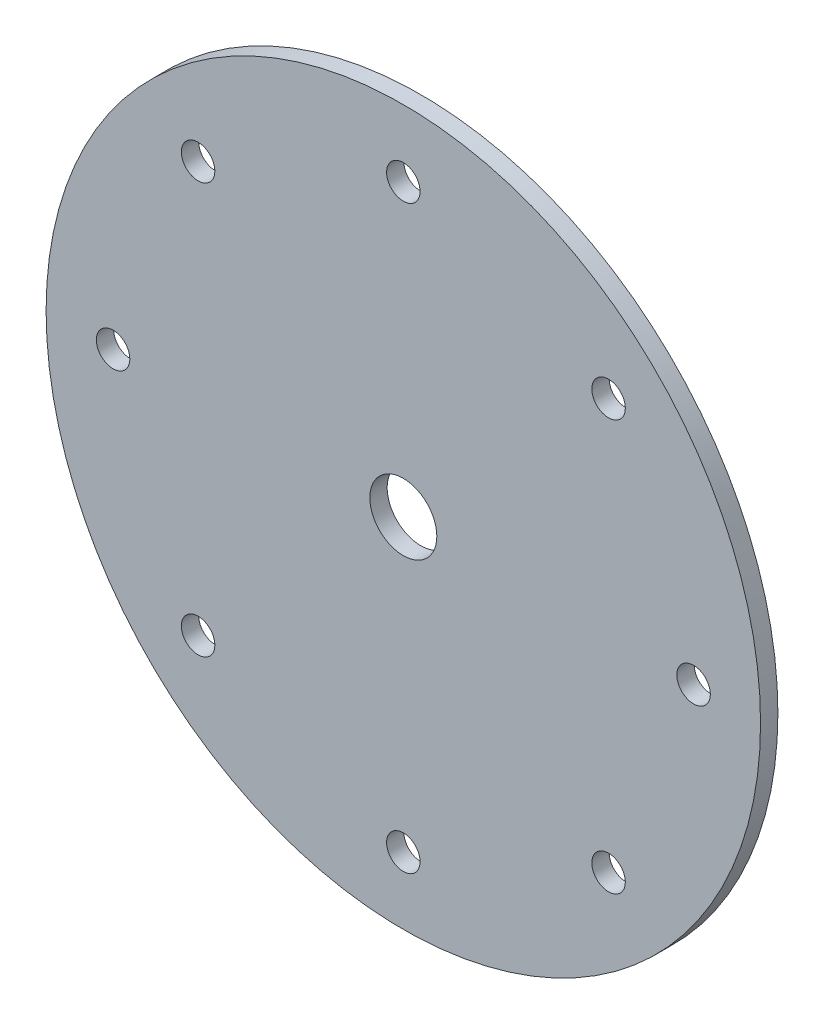
ISO-10303-21;
HEADER;
FILE_DESCRIPTION(('STEP AP214'),'2;1');
FILE_NAME('part.step','',(''),(''),'','','');
FILE_SCHEMA(('AUTOMOTIVE_DESIGN { 1 0 10303 214 1 1 1 1 }'));
ENDSEC;
DATA;
#1=APPLICATION_CONTEXT('core data for automotive mechanical design processes');
#2=APPLICATION_PROTOCOL_DEFINITION('international standard','automotive_design',2000,#1);
#3=PRODUCT_CONTEXT('',#1,'mechanical');
#4=PRODUCT('Part','Part','',(#3));
#5=PRODUCT_RELATED_PRODUCT_CATEGORY('part','',(#4));
#6=PRODUCT_DEFINITION_FORMATION('','',#4);
#7=PRODUCT_DEFINITION_CONTEXT('part definition',#1,'design');
#8=PRODUCT_DEFINITION('design','',#6,#7);
#9=PRODUCT_DEFINITION_SHAPE('','',#8);
#10=(LENGTH_UNIT() NAMED_UNIT(*) SI_UNIT(.MILLI.,.METRE.));
#11=(NAMED_UNIT(*) PLANE_ANGLE_UNIT() SI_UNIT($,.RADIAN.));
#12=(NAMED_UNIT(*) SI_UNIT($,.STERADIAN.) SOLID_ANGLE_UNIT());
#13=UNCERTAINTY_MEASURE_WITH_UNIT(LENGTH_MEASURE(1.E-05),#10,'distance_accuracy_value','');
#14=(GEOMETRIC_REPRESENTATION_CONTEXT(3) GLOBAL_UNCERTAINTY_ASSIGNED_CONTEXT((#13)) GLOBAL_UNIT_ASSIGNED_CONTEXT((#10,
#11,#12)) REPRESENTATION_CONTEXT('',''));
#15=CARTESIAN_POINT('',(0.,0.,0.));
#16=DIRECTION('',(0.,0.,1.));
#17=DIRECTION('',(1.,0.,0.));
#18=AXIS2_PLACEMENT_3D('',#15,#16,#17);
#19=CARTESIAN_POINT('',(0.,0.,4.93522));
#20=DIRECTION('',(0.,0.,-1.));
#21=DIRECTION('',(-1.,0.,0.));
#22=AXIS2_PLACEMENT_3D('',#19,#20,#21);
#23=CYLINDRICAL_SURFACE('',#22,9.525);
#24=CARTESIAN_POINT('',(0.,0.,4.93522));
#25=DIRECTION('',(0.,0.,1.));
#26=DIRECTION('',(1.,0.,0.));
#27=AXIS2_PLACEMENT_3D('',#24,#25,#26);
#28=CIRCLE('',#27,9.525);
#29=CARTESIAN_POINT('',(9.525,0.,4.93522));
#30=VERTEX_POINT('',#29);
#31=EDGE_CURVE('E46',#30,#30,#28,.T.);
#32=ORIENTED_EDGE('',*,*,#31,.T.);
#33=EDGE_LOOP('',(#32));
#34=FACE_BOUND('',#33,.T.);
#35=CARTESIAN_POINT('',(0.,0.,0.));
#36=DIRECTION('',(0.,0.,1.));
#37=DIRECTION('',(1.,0.,0.));
#38=AXIS2_PLACEMENT_3D('',#35,#36,#37);
#39=CIRCLE('',#38,9.525);
#40=CARTESIAN_POINT('',(9.525,0.,0.));
#41=VERTEX_POINT('',#40);
#42=EDGE_CURVE('E78',#41,#41,#39,.T.);
#43=ORIENTED_EDGE('',*,*,#42,.F.);
#44=EDGE_LOOP('',(#43));
#45=FACE_BOUND('',#44,.T.);
#46=ADVANCED_FACE('F38',(#34,#45),#23,.F.);
#47=CARTESIAN_POINT('',(0.,82.55,4.93522));
#48=DIRECTION('',(0.,0.,-1.));
#49=DIRECTION('',(-1.,0.,0.));
#50=AXIS2_PLACEMENT_3D('',#47,#48,#49);
#51=CYLINDRICAL_SURFACE('',#50,4.7625);
#52=CARTESIAN_POINT('',(0.,82.55,4.93522));
#53=DIRECTION('',(0.,0.,1.));
#54=DIRECTION('',(1.,0.,0.));
#55=AXIS2_PLACEMENT_3D('',#52,#53,#54);
#56=CIRCLE('',#55,4.7625);
#57=CARTESIAN_POINT('',(4.7625,82.55,4.93522));
#58=VERTEX_POINT('',#57);
#59=EDGE_CURVE('E51',#58,#58,#56,.T.);
#60=ORIENTED_EDGE('',*,*,#59,.T.);
#61=EDGE_LOOP('',(#60));
#62=FACE_BOUND('',#61,.T.);
#63=CARTESIAN_POINT('',(0.,82.55,0.));
#64=DIRECTION('',(0.,0.,1.));
#65=DIRECTION('',(1.,0.,0.));
#66=AXIS2_PLACEMENT_3D('',#63,#64,#65);
#67=CIRCLE('',#66,4.7625);
#68=CARTESIAN_POINT('',(4.7625,82.55,0.));
#69=VERTEX_POINT('',#68);
#70=EDGE_CURVE('E76',#69,#69,#67,.T.);
#71=ORIENTED_EDGE('',*,*,#70,.F.);
#72=EDGE_LOOP('',(#71));
#73=FACE_BOUND('',#72,.T.);
#74=ADVANCED_FACE('F111',(#62,#73),#51,.F.);
#75=CARTESIAN_POINT('',(58.3716647869495,58.3716647869495,4.93522));
#76=DIRECTION('',(0.,0.,-1.));
#77=DIRECTION('',(-1.,0.,0.));
#78=AXIS2_PLACEMENT_3D('',#75,#76,#77);
#79=CYLINDRICAL_SURFACE('',#78,4.76249999999999);
#80=CARTESIAN_POINT('',(58.3716647869495,58.3716647869495,4.93522));
#81=DIRECTION('',(0.,0.,1.));
#82=DIRECTION('',(1.,0.,0.));
#83=AXIS2_PLACEMENT_3D('',#80,#81,#82);
#84=CIRCLE('',#83,4.76249999999999);
#85=CARTESIAN_POINT('',(63.1341647869495,58.3716647869495,4.93522));
#86=VERTEX_POINT('',#85);
#87=EDGE_CURVE('E106',#86,#86,#84,.T.);
#88=ORIENTED_EDGE('',*,*,#87,.T.);
#89=EDGE_LOOP('',(#88));
#90=FACE_BOUND('',#89,.T.);
#91=CARTESIAN_POINT('',(58.3716647869495,58.3716647869495,0.));
#92=DIRECTION('',(0.,0.,1.));
#93=DIRECTION('',(1.,0.,0.));
#94=AXIS2_PLACEMENT_3D('',#91,#92,#93);
#95=CIRCLE('',#94,4.76249999999999);
#96=CARTESIAN_POINT('',(63.1341647869495,58.3716647869495,0.));
#97=VERTEX_POINT('',#96);
#98=EDGE_CURVE('E73',#97,#97,#95,.T.);
#99=ORIENTED_EDGE('',*,*,#98,.F.);
#100=EDGE_LOOP('',(#99));
#101=FACE_BOUND('',#100,.T.);
#102=ADVANCED_FACE('F129',(#90,#101),#79,.F.);
#103=CARTESIAN_POINT('',(82.55,0.,4.93522));
#104=DIRECTION('',(0.,0.,-1.));
#105=DIRECTION('',(-1.,0.,0.));
#106=AXIS2_PLACEMENT_3D('',#103,#104,#105);
#107=CYLINDRICAL_SURFACE('',#106,4.7625);
#108=CARTESIAN_POINT('',(82.55,0.,4.93522));
#109=DIRECTION('',(0.,0.,1.));
#110=DIRECTION('',(1.,0.,0.));
#111=AXIS2_PLACEMENT_3D('',#108,#109,#110);
#112=CIRCLE('',#111,4.7625);
#113=CARTESIAN_POINT('',(87.3125,0.,4.93522));
#114=VERTEX_POINT('',#113);
#115=EDGE_CURVE('E103',#114,#114,#112,.T.);
#116=ORIENTED_EDGE('',*,*,#115,.T.);
#117=EDGE_LOOP('',(#116));
#118=FACE_BOUND('',#117,.T.);
#119=CARTESIAN_POINT('',(82.55,0.,0.));
#120=DIRECTION('',(0.,0.,1.));
#121=DIRECTION('',(1.,0.,0.));
#122=AXIS2_PLACEMENT_3D('',#119,#120,#121);
#123=CIRCLE('',#122,4.7625);
#124=CARTESIAN_POINT('',(87.3125,0.,0.));
#125=VERTEX_POINT('',#124);
#126=EDGE_CURVE('E70',#125,#125,#123,.T.);
#127=ORIENTED_EDGE('',*,*,#126,.F.);
#128=EDGE_LOOP('',(#127));
#129=FACE_BOUND('',#128,.T.);
#130=ADVANCED_FACE('F136',(#118,#129),#107,.F.);
#131=CARTESIAN_POINT('',(58.3716647869495,-58.3716647869495,4.93522));
#132=DIRECTION('',(0.,0.,-1.));
#133=DIRECTION('',(-1.,0.,0.));
#134=AXIS2_PLACEMENT_3D('',#131,#132,#133);
#135=CYLINDRICAL_SURFACE('',#134,4.7625);
#136=CARTESIAN_POINT('',(58.3716647869495,-58.3716647869495,4.93522));
#137=DIRECTION('',(0.,0.,1.));
#138=DIRECTION('',(1.,0.,0.));
#139=AXIS2_PLACEMENT_3D('',#136,#137,#138);
#140=CIRCLE('',#139,4.7625);
#141=CARTESIAN_POINT('',(63.1341647869495,-58.3716647869495,4.93522));
#142=VERTEX_POINT('',#141);
#143=EDGE_CURVE('E100',#142,#142,#140,.T.);
#144=ORIENTED_EDGE('',*,*,#143,.T.);
#145=EDGE_LOOP('',(#144));
#146=FACE_BOUND('',#145,.T.);
#147=CARTESIAN_POINT('',(58.3716647869495,-58.3716647869495,0.));
#148=DIRECTION('',(0.,0.,1.));
#149=DIRECTION('',(1.,0.,0.));
#150=AXIS2_PLACEMENT_3D('',#147,#148,#149);
#151=CIRCLE('',#150,4.7625);
#152=CARTESIAN_POINT('',(63.1341647869495,-58.3716647869495,0.));
#153=VERTEX_POINT('',#152);
#154=EDGE_CURVE('E67',#153,#153,#151,.T.);
#155=ORIENTED_EDGE('',*,*,#154,.F.);
#156=EDGE_LOOP('',(#155));
#157=FACE_BOUND('',#156,.T.);
#158=ADVANCED_FACE('F140',(#146,#157),#135,.F.);
#159=CARTESIAN_POINT('',(0.,-82.55,4.93522));
#160=DIRECTION('',(0.,0.,-1.));
#161=DIRECTION('',(-1.,0.,0.));
#162=AXIS2_PLACEMENT_3D('',#159,#160,#161);
#163=CYLINDRICAL_SURFACE('',#162,4.7625);
#164=CARTESIAN_POINT('',(0.,-82.55,4.93522));
#165=DIRECTION('',(0.,0.,1.));
#166=DIRECTION('',(1.,0.,0.));
#167=AXIS2_PLACEMENT_3D('',#164,#165,#166);
#168=CIRCLE('',#167,4.7625);
#169=CARTESIAN_POINT('',(4.76250000000002,-82.55,4.93522));
#170=VERTEX_POINT('',#169);
#171=EDGE_CURVE('E97',#170,#170,#168,.T.);
#172=ORIENTED_EDGE('',*,*,#171,.T.);
#173=EDGE_LOOP('',(#172));
#174=FACE_BOUND('',#173,.T.);
#175=CARTESIAN_POINT('',(0.,-82.55,0.));
#176=DIRECTION('',(0.,0.,1.));
#177=DIRECTION('',(1.,0.,0.));
#178=AXIS2_PLACEMENT_3D('',#175,#176,#177);
#179=CIRCLE('',#178,4.7625);
#180=CARTESIAN_POINT('',(4.76250000000002,-82.55,0.));
#181=VERTEX_POINT('',#180);
#182=EDGE_CURVE('E64',#181,#181,#179,.T.);
#183=ORIENTED_EDGE('',*,*,#182,.F.);
#184=EDGE_LOOP('',(#183));
#185=FACE_BOUND('',#184,.T.);
#186=ADVANCED_FACE('F144',(#174,#185),#163,.F.);
#187=CARTESIAN_POINT('',(-58.3716647869495,-58.3716647869495,4.93522));
#188=DIRECTION('',(0.,0.,-1.));
#189=DIRECTION('',(-1.,0.,0.));
#190=AXIS2_PLACEMENT_3D('',#187,#188,#189);
#191=CYLINDRICAL_SURFACE('',#190,4.7625);
#192=CARTESIAN_POINT('',(-58.3716647869495,-58.3716647869495,4.93522));
#193=DIRECTION('',(0.,0.,1.));
#194=DIRECTION('',(1.,0.,0.));
#195=AXIS2_PLACEMENT_3D('',#192,#193,#194);
#196=CIRCLE('',#195,4.7625);
#197=CARTESIAN_POINT('',(-53.6091647869495,-58.3716647869495,4.93522));
#198=VERTEX_POINT('',#197);
#199=EDGE_CURVE('E92',#198,#198,#196,.T.);
#200=ORIENTED_EDGE('',*,*,#199,.T.);
#201=EDGE_LOOP('',(#200));
#202=FACE_BOUND('',#201,.T.);
#203=CARTESIAN_POINT('',(-58.3716647869495,-58.3716647869495,0.));
#204=DIRECTION('',(0.,0.,1.));
#205=DIRECTION('',(1.,0.,0.));
#206=AXIS2_PLACEMENT_3D('',#203,#204,#205);
#207=CIRCLE('',#206,4.7625);
#208=CARTESIAN_POINT('',(-53.6091647869495,-58.3716647869495,0.));
#209=VERTEX_POINT('',#208);
#210=EDGE_CURVE('E61',#209,#209,#207,.T.);
#211=ORIENTED_EDGE('',*,*,#210,.F.);
#212=EDGE_LOOP('',(#211));
#213=FACE_BOUND('',#212,.T.);
#214=ADVANCED_FACE('F148',(#202,#213),#191,.F.);
#215=CARTESIAN_POINT('',(-82.55,0.,4.93522));
#216=DIRECTION('',(0.,0.,-1.));
#217=DIRECTION('',(-1.,0.,0.));
#218=AXIS2_PLACEMENT_3D('',#215,#216,#217);
#219=CYLINDRICAL_SURFACE('',#218,4.7625);
#220=CARTESIAN_POINT('',(-82.55,0.,4.93522));
#221=DIRECTION('',(0.,0.,1.));
#222=DIRECTION('',(1.,0.,0.));
#223=AXIS2_PLACEMENT_3D('',#220,#221,#222);
#224=CIRCLE('',#223,4.7625);
#225=CARTESIAN_POINT('',(-77.7875,0.,4.93522));
#226=VERTEX_POINT('',#225);
#227=EDGE_CURVE('E87',#226,#226,#224,.T.);
#228=ORIENTED_EDGE('',*,*,#227,.T.);
#229=EDGE_LOOP('',(#228));
#230=FACE_BOUND('',#229,.T.);
#231=CARTESIAN_POINT('',(-82.55,0.,0.));
#232=DIRECTION('',(0.,0.,1.));
#233=DIRECTION('',(1.,0.,0.));
#234=AXIS2_PLACEMENT_3D('',#231,#232,#233);
#235=CIRCLE('',#234,4.7625);
#236=CARTESIAN_POINT('',(-77.7875,0.,0.));
#237=VERTEX_POINT('',#236);
#238=EDGE_CURVE('E58',#237,#237,#235,.T.);
#239=ORIENTED_EDGE('',*,*,#238,.F.);
#240=EDGE_LOOP('',(#239));
#241=FACE_BOUND('',#240,.T.);
#242=ADVANCED_FACE('F151',(#230,#241),#219,.F.);
#243=CARTESIAN_POINT('',(-58.3716647869495,58.3716647869495,4.93522));
#244=DIRECTION('',(0.,0.,-1.));
#245=DIRECTION('',(-1.,0.,0.));
#246=AXIS2_PLACEMENT_3D('',#243,#244,#245);
#247=CYLINDRICAL_SURFACE('',#246,4.7625);
#248=CARTESIAN_POINT('',(-58.3716647869495,58.3716647869495,4.93522));
#249=DIRECTION('',(0.,0.,1.));
#250=DIRECTION('',(1.,0.,0.));
#251=AXIS2_PLACEMENT_3D('',#248,#249,#250);
#252=CIRCLE('',#251,4.7625);
#253=CARTESIAN_POINT('',(-53.6091647869495,58.3716647869495,4.93522));
#254=VERTEX_POINT('',#253);
#255=EDGE_CURVE('E83',#254,#254,#252,.T.);
#256=ORIENTED_EDGE('',*,*,#255,.T.);
#257=EDGE_LOOP('',(#256));
#258=FACE_BOUND('',#257,.T.);
#259=CARTESIAN_POINT('',(-58.3716647869495,58.3716647869495,0.));
#260=DIRECTION('',(0.,0.,1.));
#261=DIRECTION('',(1.,0.,0.));
#262=AXIS2_PLACEMENT_3D('',#259,#260,#261);
#263=CIRCLE('',#262,4.7625);
#264=CARTESIAN_POINT('',(-53.6091647869495,58.3716647869495,0.));
#265=VERTEX_POINT('',#264);
#266=EDGE_CURVE('E55',#265,#265,#263,.T.);
#267=ORIENTED_EDGE('',*,*,#266,.F.);
#268=EDGE_LOOP('',(#267));
#269=FACE_BOUND('',#268,.T.);
#270=ADVANCED_FACE('F40',(#258,#269),#247,.F.);
#271=CARTESIAN_POINT('',(0.,0.,4.93522));
#272=DIRECTION('',(0.,0.,-1.));
#273=DIRECTION('',(-1.,0.,0.));
#274=AXIS2_PLACEMENT_3D('',#271,#272,#273);
#275=CYLINDRICAL_SURFACE('',#274,101.6);
#276=CARTESIAN_POINT('',(0.,0.,4.93522));
#277=DIRECTION('',(0.,0.,1.));
#278=DIRECTION('',(1.,0.,0.));
#279=AXIS2_PLACEMENT_3D('',#276,#277,#278);
#280=CIRCLE('',#279,101.6);
#281=CARTESIAN_POINT('',(101.6,0.,4.93522));
#282=VERTEX_POINT('',#281);
#283=EDGE_CURVE('E10',#282,#282,#280,.T.);
#284=ORIENTED_EDGE('',*,*,#283,.F.);
#285=EDGE_LOOP('',(#284));
#286=FACE_BOUND('',#285,.T.);
#287=CARTESIAN_POINT('',(0.,0.,0.));
#288=DIRECTION('',(0.,0.,1.));
#289=DIRECTION('',(1.,0.,0.));
#290=AXIS2_PLACEMENT_3D('',#287,#288,#289);
#291=CIRCLE('',#290,101.6);
#292=CARTESIAN_POINT('',(101.6,0.,0.));
#293=VERTEX_POINT('',#292);
#294=EDGE_CURVE('E42',#293,#293,#291,.T.);
#295=ORIENTED_EDGE('',*,*,#294,.T.);
#296=EDGE_LOOP('',(#295));
#297=FACE_BOUND('',#296,.T.);
#298=ADVANCED_FACE('F118',(#286,#297),#275,.T.);
#299=CARTESIAN_POINT('',(0.,0.,4.93522));
#300=DIRECTION('',(0.,0.,1.));
#301=DIRECTION('',(1.,0.,0.));
#302=AXIS2_PLACEMENT_3D('',#299,#300,#301);
#303=PLANE('',#302);
#304=ORIENTED_EDGE('',*,*,#255,.F.);
#305=EDGE_LOOP('',(#304));
#306=FACE_BOUND('',#305,.T.);
#307=ORIENTED_EDGE('',*,*,#227,.F.);
#308=EDGE_LOOP('',(#307));
#309=FACE_BOUND('',#308,.T.);
#310=ORIENTED_EDGE('',*,*,#199,.F.);
#311=EDGE_LOOP('',(#310));
#312=FACE_BOUND('',#311,.T.);
#313=ORIENTED_EDGE('',*,*,#171,.F.);
#314=EDGE_LOOP('',(#313));
#315=FACE_BOUND('',#314,.T.);
#316=ORIENTED_EDGE('',*,*,#143,.F.);
#317=EDGE_LOOP('',(#316));
#318=FACE_BOUND('',#317,.T.);
#319=ORIENTED_EDGE('',*,*,#115,.F.);
#320=EDGE_LOOP('',(#319));
#321=FACE_BOUND('',#320,.T.);
#322=ORIENTED_EDGE('',*,*,#87,.F.);
#323=EDGE_LOOP('',(#322));
#324=FACE_BOUND('',#323,.T.);
#325=ORIENTED_EDGE('',*,*,#59,.F.);
#326=EDGE_LOOP('',(#325));
#327=FACE_BOUND('',#326,.T.);
#328=ORIENTED_EDGE('',*,*,#31,.F.);
#329=EDGE_LOOP('',(#328));
#330=FACE_BOUND('',#329,.T.);
#331=ORIENTED_EDGE('',*,*,#283,.T.);
#332=EDGE_LOOP('',(#331));
#333=FACE_BOUND('',#332,.T.);
#334=ADVANCED_FACE('F114',(#306,#309,#312,#315,#318,#321,#324,#327,#330,#333),#303,.T.);
#335=CARTESIAN_POINT('',(0.,0.,0.));
#336=DIRECTION('',(0.,0.,1.));
#337=DIRECTION('',(1.,0.,0.));
#338=AXIS2_PLACEMENT_3D('',#335,#336,#337);
#339=PLANE('',#338);
#340=ORIENTED_EDGE('',*,*,#266,.T.);
#341=EDGE_LOOP('',(#340));
#342=FACE_BOUND('',#341,.T.);
#343=ORIENTED_EDGE('',*,*,#238,.T.);
#344=EDGE_LOOP('',(#343));
#345=FACE_BOUND('',#344,.T.);
#346=ORIENTED_EDGE('',*,*,#210,.T.);
#347=EDGE_LOOP('',(#346));
#348=FACE_BOUND('',#347,.T.);
#349=ORIENTED_EDGE('',*,*,#182,.T.);
#350=EDGE_LOOP('',(#349));
#351=FACE_BOUND('',#350,.T.);
#352=ORIENTED_EDGE('',*,*,#154,.T.);
#353=EDGE_LOOP('',(#352));
#354=FACE_BOUND('',#353,.T.);
#355=ORIENTED_EDGE('',*,*,#126,.T.);
#356=EDGE_LOOP('',(#355));
#357=FACE_BOUND('',#356,.T.);
#358=ORIENTED_EDGE('',*,*,#98,.T.);
#359=EDGE_LOOP('',(#358));
#360=FACE_BOUND('',#359,.T.);
#361=ORIENTED_EDGE('',*,*,#70,.T.);
#362=EDGE_LOOP('',(#361));
#363=FACE_BOUND('',#362,.T.);
#364=ORIENTED_EDGE('',*,*,#42,.T.);
#365=EDGE_LOOP('',(#364));
#366=FACE_BOUND('',#365,.T.);
#367=ORIENTED_EDGE('',*,*,#294,.F.);
#368=EDGE_LOOP('',(#367));
#369=FACE_BOUND('',#368,.T.);
#370=ADVANCED_FACE('F117',(#342,#345,#348,#351,#354,#357,#360,#363,#366,#369),#339,.F.);
#371=CLOSED_SHELL('',(#46,#74,#102,#130,#158,#186,#214,#242,#270,#298,#334,#370));
#372=MANIFOLD_SOLID_BREP('B2',#371);
#373=ADVANCED_BREP_SHAPE_REPRESENTATION('',(#18,#372),#14);
#374=SHAPE_DEFINITION_REPRESENTATION(#9,#373);
ENDSEC;
END-ISO-10303-21;
